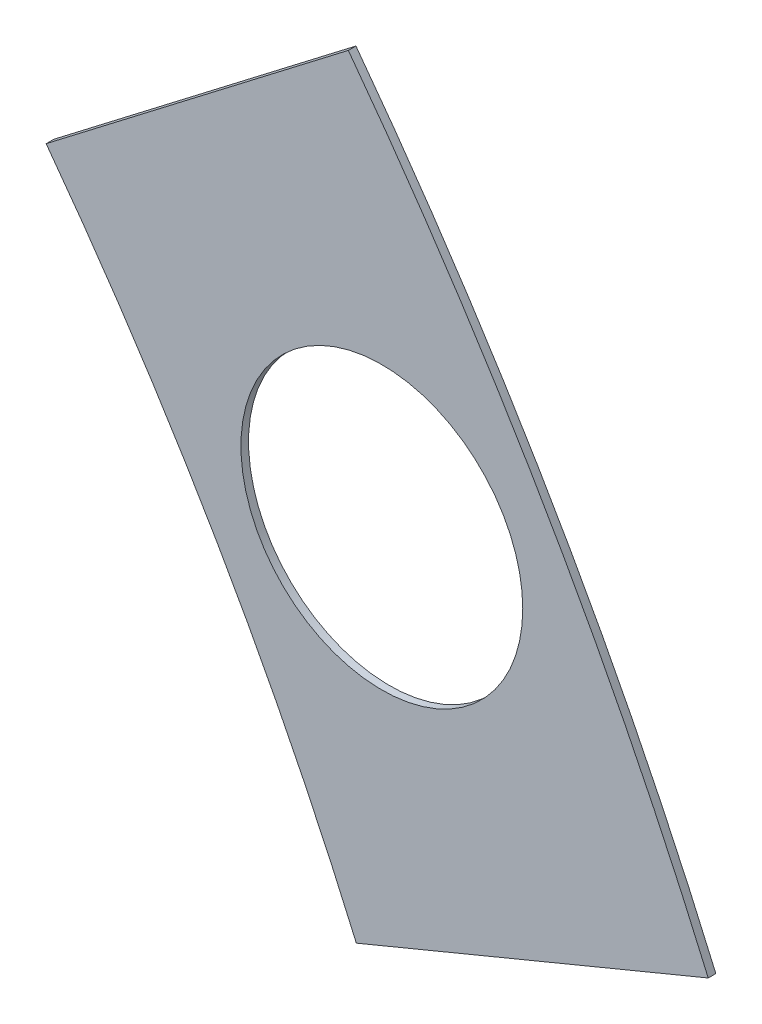
ISO-10303-21;
HEADER;
FILE_DESCRIPTION(('STEP AP214'),'2;1');
FILE_NAME('part.step','',(''),(''),'','','');
FILE_SCHEMA(('AUTOMOTIVE_DESIGN { 1 0 10303 214 1 1 1 1 }'));
ENDSEC;
DATA;
#1=APPLICATION_CONTEXT('core data for automotive mechanical design processes');
#2=APPLICATION_PROTOCOL_DEFINITION('international standard','automotive_design',2000,#1);
#3=PRODUCT_CONTEXT('',#1,'mechanical');
#4=PRODUCT('Part','Part','',(#3));
#5=PRODUCT_RELATED_PRODUCT_CATEGORY('part','',(#4));
#6=PRODUCT_DEFINITION_FORMATION('','',#4);
#7=PRODUCT_DEFINITION_CONTEXT('part definition',#1,'design');
#8=PRODUCT_DEFINITION('design','',#6,#7);
#9=PRODUCT_DEFINITION_SHAPE('','',#8);
#10=(LENGTH_UNIT() NAMED_UNIT(*) SI_UNIT(.MILLI.,.METRE.));
#11=(NAMED_UNIT(*) PLANE_ANGLE_UNIT() SI_UNIT($,.RADIAN.));
#12=(NAMED_UNIT(*) SI_UNIT($,.STERADIAN.) SOLID_ANGLE_UNIT());
#13=UNCERTAINTY_MEASURE_WITH_UNIT(LENGTH_MEASURE(1.E-05),#10,'distance_accuracy_value','');
#14=(GEOMETRIC_REPRESENTATION_CONTEXT(3) GLOBAL_UNCERTAINTY_ASSIGNED_CONTEXT((#13)) GLOBAL_UNIT_ASSIGNED_CONTEXT((#10,
#11,#12)) REPRESENTATION_CONTEXT('',''));
#15=CARTESIAN_POINT('',(0.,0.,0.));
#16=DIRECTION('',(0.,0.,1.));
#17=DIRECTION('',(1.,0.,0.));
#18=AXIS2_PLACEMENT_3D('',#15,#16,#17);
#19=CARTESIAN_POINT('',(0.,0.,0.254));
#20=DIRECTION('',(0.,0.,-1.));
#21=DIRECTION('',(-1.,0.,0.));
#22=AXIS2_PLACEMENT_3D('',#19,#20,#21);
#23=PLANE('',#22);
#24=CARTESIAN_POINT('',(82.4889197104677,47.6250000000001,0.254));
#25=DIRECTION('',(0.,0.,1.));
#26=DIRECTION('',(1.,0.,0.));
#27=AXIS2_PLACEMENT_3D('',#24,#25,#26);
#28=CIRCLE('',#27,4.69899999999999);
#29=CARTESIAN_POINT('',(87.1879197104677,47.6250000000001,0.254));
#30=VERTEX_POINT('',#29);
#31=EDGE_CURVE('E99',#30,#30,#28,.T.);
#32=ORIENTED_EDGE('',*,*,#31,.F.);
#33=EDGE_LOOP('',(#32));
#34=FACE_BOUND('',#33,.T.);
#35=DIRECTION('',(0.793353340291242,0.608761429008712,0.));
#36=VECTOR('',#35,1.);
#37=CARTESIAN_POINT('',(80.8740470173455,60.4560389376958,0.254));
#38=LINE('',#37,#36);
#39=CARTESIAN_POINT('',(71.2950417513496,53.1058096791049,0.254));
#40=VERTEX_POINT('',#39);
#41=CARTESIAN_POINT('',(81.3715289002867,60.8377702125071,0.254));
#42=VERTEX_POINT('',#41);
#43=EDGE_CURVE('E72',#40,#42,#38,.T.);
#44=ORIENTED_EDGE('',*,*,#43,.F.);
#45=CARTESIAN_POINT('',(0.,0.,0.254));
#46=DIRECTION('',(0.,0.,1.));
#47=DIRECTION('',(-1.,0.,0.));
#48=AXIS2_PLACEMENT_3D('',#45,#46,#47);
#49=CIRCLE('',#48,88.9);
#50=CARTESIAN_POINT('',(81.638501146321,35.190412480989,0.254));
#51=VERTEX_POINT('',#50);
#52=EDGE_CURVE('E75',#51,#40,#49,.T.);
#53=ORIENTED_EDGE('',*,*,#52,.F.);
#54=DIRECTION('',(-0.923879532511287,-0.382683432365089,0.));
#55=VECTOR('',#54,1.);
#56=CARTESIAN_POINT('',(92.7934890408984,39.8109597550307,0.254));
#57=LINE('',#56,#55);
#58=CARTESIAN_POINT('',(93.3728189637746,40.0509260661746,0.254));
#59=VERTEX_POINT('',#58);
#60=EDGE_CURVE('E106',#59,#51,#57,.T.);
#61=ORIENTED_EDGE('',*,*,#60,.F.);
#62=CARTESIAN_POINT('',(0.,0.,0.254));
#63=DIRECTION('',(0.,0.,1.));
#64=DIRECTION('',(-1.,0.,0.));
#65=AXIS2_PLACEMENT_3D('',#62,#63,#64);
#66=CIRCLE('',#65,101.6);
#67=EDGE_CURVE('E43',#59,#42,#66,.T.);
#68=ORIENTED_EDGE('',*,*,#67,.T.);
#69=EDGE_LOOP('',(#44,#53,#61,#68));
#70=FACE_BOUND('',#69,.T.);
#71=ADVANCED_FACE('F35',(#34,#70),#23,.F.);
#72=CARTESIAN_POINT('',(0.,0.,0.));
#73=DIRECTION('',(0.,0.,-1.));
#74=DIRECTION('',(-1.,0.,0.));
#75=AXIS2_PLACEMENT_3D('',#72,#73,#74);
#76=PLANE('',#75);
#77=CARTESIAN_POINT('',(82.4889197104677,47.6250000000001,0.));
#78=DIRECTION('',(0.,0.,1.));
#79=DIRECTION('',(1.,0.,0.));
#80=AXIS2_PLACEMENT_3D('',#77,#78,#79);
#81=CIRCLE('',#80,4.69899999999999);
#82=CARTESIAN_POINT('',(87.1879197104677,47.6250000000001,0.));
#83=VERTEX_POINT('',#82);
#84=EDGE_CURVE('E96',#83,#83,#81,.T.);
#85=ORIENTED_EDGE('',*,*,#84,.T.);
#86=EDGE_LOOP('',(#85));
#87=FACE_BOUND('',#86,.T.);
#88=CARTESIAN_POINT('',(0.,0.,0.));
#89=DIRECTION('',(0.,0.,1.));
#90=DIRECTION('',(-1.,0.,0.));
#91=AXIS2_PLACEMENT_3D('',#88,#89,#90);
#92=CIRCLE('',#91,88.9);
#93=CARTESIAN_POINT('',(81.638501146321,35.190412480989,0.));
#94=VERTEX_POINT('',#93);
#95=CARTESIAN_POINT('',(71.2950417513496,53.1058096791049,0.));
#96=VERTEX_POINT('',#95);
#97=EDGE_CURVE('E93',#94,#96,#92,.T.);
#98=ORIENTED_EDGE('',*,*,#97,.T.);
#99=DIRECTION('',(0.793353340291242,0.608761429008712,0.));
#100=VECTOR('',#99,1.);
#101=CARTESIAN_POINT('',(80.8740470173455,60.4560389376958,0.));
#102=LINE('',#101,#100);
#103=CARTESIAN_POINT('',(81.3715289002867,60.8377702125071,0.));
#104=VERTEX_POINT('',#103);
#105=EDGE_CURVE('E79',#96,#104,#102,.T.);
#106=ORIENTED_EDGE('',*,*,#105,.T.);
#107=CARTESIAN_POINT('',(0.,0.,0.));
#108=DIRECTION('',(0.,0.,1.));
#109=DIRECTION('',(-1.,0.,0.));
#110=AXIS2_PLACEMENT_3D('',#107,#108,#109);
#111=CIRCLE('',#110,101.6);
#112=CARTESIAN_POINT('',(93.3728189637746,40.0509260661746,0.));
#113=VERTEX_POINT('',#112);
#114=EDGE_CURVE('E92',#113,#104,#111,.T.);
#115=ORIENTED_EDGE('',*,*,#114,.F.);
#116=DIRECTION('',(0.923879532511287,0.382683432365089,0.));
#117=VECTOR('',#116,1.);
#118=CARTESIAN_POINT('',(-0.486007959103745,1.17332700628953,0.));
#119=LINE('',#118,#117);
#120=EDGE_CURVE('E12',#94,#113,#119,.T.);
#121=ORIENTED_EDGE('',*,*,#120,.F.);
#122=EDGE_LOOP('',(#98,#106,#115,#121));
#123=FACE_BOUND('',#122,.T.);
#124=ADVANCED_FACE('F113',(#87,#123),#76,.T.);
#125=CARTESIAN_POINT('',(0.,0.,0.254));
#126=DIRECTION('',(0.,0.,-1.));
#127=DIRECTION('',(-1.,0.,0.));
#128=AXIS2_PLACEMENT_3D('',#125,#126,#127);
#129=CYLINDRICAL_SURFACE('',#128,88.9);
#130=ORIENTED_EDGE('',*,*,#52,.T.);
#131=DIRECTION('',(0.,0.,-1.));
#132=VECTOR('',#131,1.);
#133=CARTESIAN_POINT('',(71.2950417513496,53.1058096791049,0.254));
#134=LINE('',#133,#132);
#135=EDGE_CURVE('E83',#40,#96,#134,.T.);
#136=ORIENTED_EDGE('',*,*,#135,.T.);
#137=ORIENTED_EDGE('',*,*,#97,.F.);
#138=DIRECTION('',(0.,0.,-1.));
#139=VECTOR('',#138,1.);
#140=CARTESIAN_POINT('',(81.638501146321,35.190412480989,0.254));
#141=LINE('',#140,#139);
#142=EDGE_CURVE('E80',#94,#51,#141,.F.);
#143=ORIENTED_EDGE('',*,*,#142,.T.);
#144=EDGE_LOOP('',(#130,#136,#137,#143));
#145=FACE_BOUND('',#144,.T.);
#146=ADVANCED_FACE('F91',(#145),#129,.F.);
#147=CARTESIAN_POINT('',(0.,0.,0.254));
#148=DIRECTION('',(0.,0.,-1.));
#149=DIRECTION('',(-1.,0.,0.));
#150=AXIS2_PLACEMENT_3D('',#147,#148,#149);
#151=CYLINDRICAL_SURFACE('',#150,101.6);
#152=ORIENTED_EDGE('',*,*,#114,.T.);
#153=DIRECTION('',(0.,0.,-1.));
#154=VECTOR('',#153,1.);
#155=CARTESIAN_POINT('',(81.3715289002867,60.8377702125071,0.254));
#156=LINE('',#155,#154);
#157=EDGE_CURVE('E108',#104,#42,#156,.F.);
#158=ORIENTED_EDGE('',*,*,#157,.T.);
#159=ORIENTED_EDGE('',*,*,#67,.F.);
#160=DIRECTION('',(0.,0.,-1.));
#161=VECTOR('',#160,1.);
#162=CARTESIAN_POINT('',(93.3728189637746,40.0509260661746,0.254));
#163=LINE('',#162,#161);
#164=EDGE_CURVE('E52',#59,#113,#163,.T.);
#165=ORIENTED_EDGE('',*,*,#164,.T.);
#166=EDGE_LOOP('',(#152,#158,#159,#165));
#167=FACE_BOUND('',#166,.T.);
#168=ADVANCED_FACE('F37',(#167),#151,.T.);
#169=CARTESIAN_POINT('',(82.4889197104677,47.6250000000001,0.));
#170=DIRECTION('',(0.,0.,1.));
#171=DIRECTION('',(1.,0.,0.));
#172=AXIS2_PLACEMENT_3D('',#169,#170,#171);
#173=CYLINDRICAL_SURFACE('',#172,4.69899999999999);
#174=ORIENTED_EDGE('',*,*,#84,.F.);
#175=EDGE_LOOP('',(#174));
#176=FACE_BOUND('',#175,.T.);
#177=ORIENTED_EDGE('',*,*,#31,.T.);
#178=EDGE_LOOP('',(#177));
#179=FACE_BOUND('',#178,.T.);
#180=ADVANCED_FACE('F116',(#176,#179),#173,.F.);
#181=CARTESIAN_POINT('',(92.7934890408984,39.8109597550307,0.));
#182=DIRECTION('',(-0.382683432365089,0.923879532511287,0.));
#183=DIRECTION('',(-0.923879532511287,-0.382683432365089,0.));
#184=AXIS2_PLACEMENT_3D('',#181,#182,#183);
#185=PLANE('',#184);
#186=ORIENTED_EDGE('',*,*,#60,.T.);
#187=ORIENTED_EDGE('',*,*,#142,.F.);
#188=ORIENTED_EDGE('',*,*,#120,.T.);
#189=ORIENTED_EDGE('',*,*,#164,.F.);
#190=EDGE_LOOP('',(#186,#187,#188,#189));
#191=FACE_BOUND('',#190,.T.);
#192=ADVANCED_FACE('F121',(#191),#185,.F.);
#193=CARTESIAN_POINT('',(80.8740470173455,60.4560389376958,0.));
#194=DIRECTION('',(0.608761429008712,-0.793353340291242,0.));
#195=DIRECTION('',(0.793353340291242,0.608761429008712,0.));
#196=AXIS2_PLACEMENT_3D('',#193,#194,#195);
#197=PLANE('',#196);
#198=ORIENTED_EDGE('',*,*,#105,.F.);
#199=ORIENTED_EDGE('',*,*,#135,.F.);
#200=ORIENTED_EDGE('',*,*,#43,.T.);
#201=ORIENTED_EDGE('',*,*,#157,.F.);
#202=EDGE_LOOP('',(#198,#199,#200,#201));
#203=FACE_BOUND('',#202,.T.);
#204=ADVANCED_FACE('F84',(#203),#197,.F.);
#205=CLOSED_SHELL('',(#71,#124,#146,#168,#180,#192,#204));
#206=MANIFOLD_SOLID_BREP('B2',#205);
#207=ADVANCED_BREP_SHAPE_REPRESENTATION('',(#18,#206),#14);
#208=SHAPE_DEFINITION_REPRESENTATION(#9,#207);
ENDSEC;
END-ISO-10303-21;
